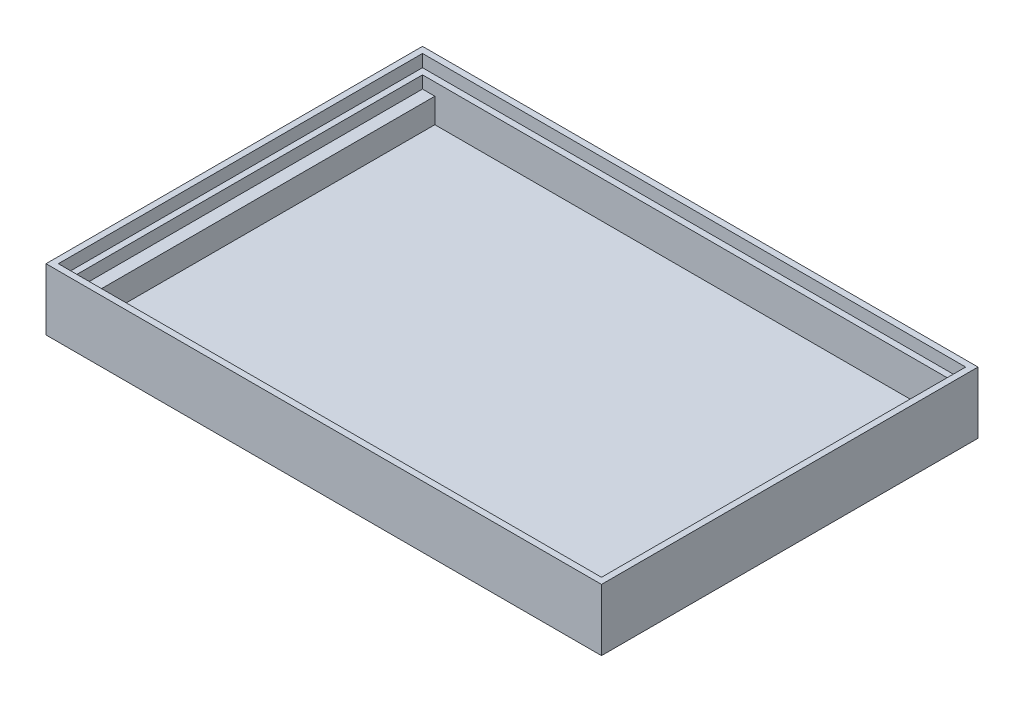
ISO-10303-21;
HEADER;
FILE_DESCRIPTION(('STEP AP214'),'2;1');
FILE_NAME('part.step','',(''),(''),'','','');
FILE_SCHEMA(('AUTOMOTIVE_DESIGN { 1 0 10303 214 1 1 1 1 }'));
ENDSEC;
DATA;
#1=APPLICATION_CONTEXT('core data for automotive mechanical design processes');
#2=APPLICATION_PROTOCOL_DEFINITION('international standard','automotive_design',2000,#1);
#3=PRODUCT_CONTEXT('',#1,'mechanical');
#4=PRODUCT('Part','Part','',(#3));
#5=PRODUCT_RELATED_PRODUCT_CATEGORY('part','',(#4));
#6=PRODUCT_DEFINITION_FORMATION('','',#4);
#7=PRODUCT_DEFINITION_CONTEXT('part definition',#1,'design');
#8=PRODUCT_DEFINITION('design','',#6,#7);
#9=PRODUCT_DEFINITION_SHAPE('','',#8);
#10=(LENGTH_UNIT() NAMED_UNIT(*) SI_UNIT(.MILLI.,.METRE.));
#11=(NAMED_UNIT(*) PLANE_ANGLE_UNIT() SI_UNIT($,.RADIAN.));
#12=(NAMED_UNIT(*) SI_UNIT($,.STERADIAN.) SOLID_ANGLE_UNIT());
#13=UNCERTAINTY_MEASURE_WITH_UNIT(LENGTH_MEASURE(1.E-05),#10,'distance_accuracy_value','');
#14=(GEOMETRIC_REPRESENTATION_CONTEXT(3) GLOBAL_UNCERTAINTY_ASSIGNED_CONTEXT((#13)) GLOBAL_UNIT_ASSIGNED_CONTEXT((#10,
#11,#12)) REPRESENTATION_CONTEXT('',''));
#15=CARTESIAN_POINT('',(0.,0.,0.));
#16=DIRECTION('',(0.,0.,1.));
#17=DIRECTION('',(1.,0.,0.));
#18=AXIS2_PLACEMENT_3D('',#15,#16,#17);
#19=CARTESIAN_POINT('',(88.,10.,-59.));
#20=DIRECTION('',(0.,0.,1.));
#21=DIRECTION('',(1.,0.,0.));
#22=AXIS2_PLACEMENT_3D('',#19,#20,#21);
#23=PLANE('',#22);
#24=DIRECTION('',(0.,-1.,0.));
#25=VECTOR('',#24,1.);
#26=CARTESIAN_POINT('',(88.,10.,-59.));
#27=LINE('',#26,#25);
#28=CARTESIAN_POINT('',(88.,8.,-59.));
#29=VERTEX_POINT('',#28);
#30=CARTESIAN_POINT('',(88.,6.,-59.));
#31=VERTEX_POINT('',#30);
#32=EDGE_CURVE('E194',#29,#31,#27,.T.);
#33=ORIENTED_EDGE('',*,*,#32,.F.);
#34=DIRECTION('',(-1.,0.,0.));
#35=VECTOR('',#34,1.);
#36=CARTESIAN_POINT('',(88.,8.,-59.));
#37=LINE('',#36,#35);
#38=CARTESIAN_POINT('',(2.,8.,-59.));
#39=VERTEX_POINT('',#38);
#40=EDGE_CURVE('E58',#29,#39,#37,.T.);
#41=ORIENTED_EDGE('',*,*,#40,.T.);
#42=DIRECTION('',(0.,-1.,0.));
#43=VECTOR('',#42,1.);
#44=CARTESIAN_POINT('',(2.,10.,-59.));
#45=LINE('',#44,#43);
#46=CARTESIAN_POINT('',(2.,6.,-59.));
#47=VERTEX_POINT('',#46);
#48=EDGE_CURVE('E186',#39,#47,#45,.T.);
#49=ORIENTED_EDGE('',*,*,#48,.T.);
#50=DIRECTION('',(-1.,0.,0.));
#51=VECTOR('',#50,1.);
#52=CARTESIAN_POINT('',(2.,6.,-59.));
#53=LINE('',#52,#51);
#54=CARTESIAN_POINT('',(4.,6.,-59.));
#55=VERTEX_POINT('',#54);
#56=EDGE_CURVE('E301',#55,#47,#53,.T.);
#57=ORIENTED_EDGE('',*,*,#56,.F.);
#58=DIRECTION('',(0.,-1.,0.));
#59=VECTOR('',#58,1.);
#60=CARTESIAN_POINT('',(4.,6.,-59.));
#61=LINE('',#60,#59);
#62=CARTESIAN_POINT('',(4.,2.,-59.));
#63=VERTEX_POINT('',#62);
#64=EDGE_CURVE('E299',#55,#63,#61,.T.);
#65=ORIENTED_EDGE('',*,*,#64,.T.);
#66=DIRECTION('',(-1.,0.,0.));
#67=VECTOR('',#66,1.);
#68=CARTESIAN_POINT('',(88.,2.,-59.));
#69=LINE('',#68,#67);
#70=CARTESIAN_POINT('',(86.,2.,-59.));
#71=VERTEX_POINT('',#70);
#72=EDGE_CURVE('E231',#71,#63,#69,.T.);
#73=ORIENTED_EDGE('',*,*,#72,.F.);
#74=DIRECTION('',(0.,-1.,0.));
#75=VECTOR('',#74,1.);
#76=CARTESIAN_POINT('',(86.,6.,-59.));
#77=LINE('',#76,#75);
#78=CARTESIAN_POINT('',(86.,6.,-59.));
#79=VERTEX_POINT('',#78);
#80=EDGE_CURVE('E311',#79,#71,#77,.T.);
#81=ORIENTED_EDGE('',*,*,#80,.F.);
#82=DIRECTION('',(-1.,0.,0.));
#83=VECTOR('',#82,1.);
#84=CARTESIAN_POINT('',(88.,6.,-59.));
#85=LINE('',#84,#83);
#86=EDGE_CURVE('E331',#31,#79,#85,.T.);
#87=ORIENTED_EDGE('',*,*,#86,.F.);
#88=EDGE_LOOP('',(#33,#41,#49,#57,#65,#73,#81,#87));
#89=FACE_BOUND('',#88,.T.);
#90=ADVANCED_FACE('F32',(#89),#23,.T.);
#91=CARTESIAN_POINT('',(2.,10.,-2.));
#92=DIRECTION('',(0.,0.,-1.));
#93=DIRECTION('',(-1.,0.,0.));
#94=AXIS2_PLACEMENT_3D('',#91,#92,#93);
#95=PLANE('',#94);
#96=DIRECTION('',(0.,-1.,0.));
#97=VECTOR('',#96,1.);
#98=CARTESIAN_POINT('',(2.,10.,-2.));
#99=LINE('',#98,#97);
#100=CARTESIAN_POINT('',(2.,8.,-2.));
#101=VERTEX_POINT('',#100);
#102=CARTESIAN_POINT('',(2.,6.,-2.));
#103=VERTEX_POINT('',#102);
#104=EDGE_CURVE('E184',#101,#103,#99,.T.);
#105=ORIENTED_EDGE('',*,*,#104,.F.);
#106=DIRECTION('',(1.,0.,0.));
#107=VECTOR('',#106,1.);
#108=CARTESIAN_POINT('',(2.,8.,-2.));
#109=LINE('',#108,#107);
#110=CARTESIAN_POINT('',(88.,8.,-2.));
#111=VERTEX_POINT('',#110);
#112=EDGE_CURVE('E170',#101,#111,#109,.T.);
#113=ORIENTED_EDGE('',*,*,#112,.T.);
#114=DIRECTION('',(0.,-1.,0.));
#115=VECTOR('',#114,1.);
#116=CARTESIAN_POINT('',(88.,10.,-2.));
#117=LINE('',#116,#115);
#118=CARTESIAN_POINT('',(88.,6.,-2.));
#119=VERTEX_POINT('',#118);
#120=EDGE_CURVE('E192',#111,#119,#117,.T.);
#121=ORIENTED_EDGE('',*,*,#120,.T.);
#122=DIRECTION('',(1.,0.,0.));
#123=VECTOR('',#122,1.);
#124=CARTESIAN_POINT('',(86.,6.,-2.));
#125=LINE('',#124,#123);
#126=CARTESIAN_POINT('',(86.,6.,-2.));
#127=VERTEX_POINT('',#126);
#128=EDGE_CURVE('E320',#127,#119,#125,.T.);
#129=ORIENTED_EDGE('',*,*,#128,.F.);
#130=DIRECTION('',(0.,-1.,0.));
#131=VECTOR('',#130,1.);
#132=CARTESIAN_POINT('',(86.,6.,-2.));
#133=LINE('',#132,#131);
#134=CARTESIAN_POINT('',(86.,2.,-2.));
#135=VERTEX_POINT('',#134);
#136=EDGE_CURVE('E318',#127,#135,#133,.T.);
#137=ORIENTED_EDGE('',*,*,#136,.T.);
#138=DIRECTION('',(1.,0.,0.));
#139=VECTOR('',#138,1.);
#140=CARTESIAN_POINT('',(2.,2.,-2.));
#141=LINE('',#140,#139);
#142=CARTESIAN_POINT('',(83.,2.,-2.));
#143=VERTEX_POINT('',#142);
#144=EDGE_CURVE('E228',#143,#135,#141,.T.);
#145=ORIENTED_EDGE('',*,*,#144,.F.);
#146=DIRECTION('',(0.,1.,0.));
#147=VECTOR('',#146,1.);
#148=CARTESIAN_POINT('',(83.,0.,-2.));
#149=LINE('',#148,#147);
#150=CARTESIAN_POINT('',(83.,0.,-2.));
#151=VERTEX_POINT('',#150);
#152=EDGE_CURVE('E241',#151,#143,#149,.T.);
#153=ORIENTED_EDGE('',*,*,#152,.F.);
#154=DIRECTION('',(1.,0.,0.));
#155=VECTOR('',#154,1.);
#156=CARTESIAN_POINT('',(57.,0.,-2.));
#157=LINE('',#156,#155);
#158=CARTESIAN_POINT('',(57.,0.,-2.));
#159=VERTEX_POINT('',#158);
#160=EDGE_CURVE('E261',#159,#151,#157,.T.);
#161=ORIENTED_EDGE('',*,*,#160,.F.);
#162=DIRECTION('',(0.,1.,0.));
#163=VECTOR('',#162,1.);
#164=CARTESIAN_POINT('',(57.,0.,-2.));
#165=LINE('',#164,#163);
#166=CARTESIAN_POINT('',(57.,2.,-2.));
#167=VERTEX_POINT('',#166);
#168=EDGE_CURVE('E232',#159,#167,#165,.T.);
#169=ORIENTED_EDGE('',*,*,#168,.T.);
#170=CARTESIAN_POINT('',(4.00000000000001,2.,-2.));
#171=VERTEX_POINT('',#170);
#172=EDGE_CURVE('E36',#171,#167,#141,.T.);
#173=ORIENTED_EDGE('',*,*,#172,.F.);
#174=DIRECTION('',(0.,-1.,0.));
#175=VECTOR('',#174,1.);
#176=CARTESIAN_POINT('',(4.00000000000001,6.,-2.));
#177=LINE('',#176,#175);
#178=CARTESIAN_POINT('',(4.00000000000001,6.,-2.));
#179=VERTEX_POINT('',#178);
#180=EDGE_CURVE('E254',#179,#171,#177,.T.);
#181=ORIENTED_EDGE('',*,*,#180,.F.);
#182=DIRECTION('',(1.,0.,0.));
#183=VECTOR('',#182,1.);
#184=CARTESIAN_POINT('',(4.00000000000001,6.,-2.));
#185=LINE('',#184,#183);
#186=EDGE_CURVE('E191',#103,#179,#185,.T.);
#187=ORIENTED_EDGE('',*,*,#186,.F.);
#188=EDGE_LOOP('',(#105,#113,#121,#129,#137,#145,#153,#161,#169,#173,#181,#187));
#189=FACE_BOUND('',#188,.T.);
#190=ADVANCED_FACE('F189',(#189),#95,.T.);
#191=CARTESIAN_POINT('',(2.,10.,-59.));
#192=DIRECTION('',(1.,0.,0.));
#193=DIRECTION('',(0.,0.,-1.));
#194=AXIS2_PLACEMENT_3D('',#191,#192,#193);
#195=PLANE('',#194);
#196=ORIENTED_EDGE('',*,*,#48,.F.);
#197=DIRECTION('',(0.,0.,1.));
#198=VECTOR('',#197,1.);
#199=CARTESIAN_POINT('',(2.,8.,-59.));
#200=LINE('',#199,#198);
#201=EDGE_CURVE('E174',#39,#101,#200,.T.);
#202=ORIENTED_EDGE('',*,*,#201,.T.);
#203=ORIENTED_EDGE('',*,*,#104,.T.);
#204=DIRECTION('',(0.,0.,1.));
#205=VECTOR('',#204,1.);
#206=CARTESIAN_POINT('',(2.,6.,-2.));
#207=LINE('',#206,#205);
#208=EDGE_CURVE('E310',#47,#103,#207,.T.);
#209=ORIENTED_EDGE('',*,*,#208,.F.);
#210=EDGE_LOOP('',(#196,#202,#203,#209));
#211=FACE_BOUND('',#210,.T.);
#212=ADVANCED_FACE('F182',(#211),#195,.T.);
#213=CARTESIAN_POINT('',(88.,10.,-2.));
#214=DIRECTION('',(-1.,0.,0.));
#215=DIRECTION('',(0.,0.,1.));
#216=AXIS2_PLACEMENT_3D('',#213,#214,#215);
#217=PLANE('',#216);
#218=ORIENTED_EDGE('',*,*,#120,.F.);
#219=DIRECTION('',(0.,0.,-1.));
#220=VECTOR('',#219,1.);
#221=CARTESIAN_POINT('',(88.,8.,-2.));
#222=LINE('',#221,#220);
#223=EDGE_CURVE('E175',#111,#29,#222,.T.);
#224=ORIENTED_EDGE('',*,*,#223,.T.);
#225=ORIENTED_EDGE('',*,*,#32,.T.);
#226=DIRECTION('',(0.,0.,-1.));
#227=VECTOR('',#226,1.);
#228=CARTESIAN_POINT('',(88.,6.,-2.));
#229=LINE('',#228,#227);
#230=EDGE_CURVE('E324',#119,#31,#229,.T.);
#231=ORIENTED_EDGE('',*,*,#230,.F.);
#232=EDGE_LOOP('',(#218,#224,#225,#231));
#233=FACE_BOUND('',#232,.T.);
#234=ADVANCED_FACE('F368',(#233),#217,.T.);
#235=CARTESIAN_POINT('',(0.,2.,0.));
#236=DIRECTION('',(0.,1.,0.));
#237=DIRECTION('',(0.,0.,1.));
#238=AXIS2_PLACEMENT_3D('',#235,#236,#237);
#239=PLANE('',#238);
#240=ORIENTED_EDGE('',*,*,#144,.T.);
#241=DIRECTION('',(0.,0.,1.));
#242=VECTOR('',#241,1.);
#243=CARTESIAN_POINT('',(86.,2.,-59.));
#244=LINE('',#243,#242);
#245=EDGE_CURVE('E321',#71,#135,#244,.T.);
#246=ORIENTED_EDGE('',*,*,#245,.F.);
#247=ORIENTED_EDGE('',*,*,#72,.T.);
#248=DIRECTION('',(0.,0.,-1.));
#249=VECTOR('',#248,1.);
#250=CARTESIAN_POINT('',(4.,2.,-59.));
#251=LINE('',#250,#249);
#252=EDGE_CURVE('E296',#171,#63,#251,.T.);
#253=ORIENTED_EDGE('',*,*,#252,.F.);
#254=ORIENTED_EDGE('',*,*,#172,.T.);
#255=DIRECTION('',(0.,0.,1.));
#256=VECTOR('',#255,1.);
#257=CARTESIAN_POINT('',(57.,2.,-9.));
#258=LINE('',#257,#256);
#259=CARTESIAN_POINT('',(57.,2.,-9.));
#260=VERTEX_POINT('',#259);
#261=EDGE_CURVE('E246',#260,#167,#258,.T.);
#262=ORIENTED_EDGE('',*,*,#261,.F.);
#263=DIRECTION('',(-1.,0.,0.));
#264=VECTOR('',#263,1.);
#265=CARTESIAN_POINT('',(83.,2.,-9.));
#266=LINE('',#265,#264);
#267=CARTESIAN_POINT('',(83.,2.,-9.));
#268=VERTEX_POINT('',#267);
#269=EDGE_CURVE('E244',#268,#260,#266,.T.);
#270=ORIENTED_EDGE('',*,*,#269,.F.);
#271=DIRECTION('',(0.,0.,-1.));
#272=VECTOR('',#271,1.);
#273=CARTESIAN_POINT('',(83.,2.,-2.));
#274=LINE('',#273,#272);
#275=EDGE_CURVE('E247',#143,#268,#274,.T.);
#276=ORIENTED_EDGE('',*,*,#275,.F.);
#277=EDGE_LOOP('',(#240,#246,#247,#253,#254,#262,#270,#276));
#278=FACE_BOUND('',#277,.T.);
#279=ADVANCED_FACE('F293',(#278),#239,.T.);
#280=CARTESIAN_POINT('',(0.,2.,-61.));
#281=DIRECTION('',(1.,0.,0.));
#282=DIRECTION('',(0.,0.,-1.));
#283=AXIS2_PLACEMENT_3D('',#280,#281,#282);
#284=PLANE('',#283);
#285=DIRECTION('',(0.,0.,1.));
#286=VECTOR('',#285,1.);
#287=CARTESIAN_POINT('',(0.,0.,-61.));
#288=LINE('',#287,#286);
#289=CARTESIAN_POINT('',(0.,0.,-61.));
#290=VERTEX_POINT('',#289);
#291=CARTESIAN_POINT('',(0.,0.,0.));
#292=VERTEX_POINT('',#291);
#293=EDGE_CURVE('E211',#290,#292,#288,.T.);
#294=ORIENTED_EDGE('',*,*,#293,.T.);
#295=DIRECTION('',(0.,-1.,0.));
#296=VECTOR('',#295,1.);
#297=CARTESIAN_POINT('',(0.,2.,0.));
#298=LINE('',#297,#296);
#299=CARTESIAN_POINT('',(0.,10.,0.));
#300=VERTEX_POINT('',#299);
#301=EDGE_CURVE('E11',#300,#292,#298,.T.);
#302=ORIENTED_EDGE('',*,*,#301,.F.);
#303=DIRECTION('',(0.,0.,1.));
#304=VECTOR('',#303,1.);
#305=CARTESIAN_POINT('',(0.,10.,-61.));
#306=LINE('',#305,#304);
#307=CARTESIAN_POINT('',(0.,10.,-61.));
#308=VERTEX_POINT('',#307);
#309=EDGE_CURVE('E205',#308,#300,#306,.T.);
#310=ORIENTED_EDGE('',*,*,#309,.F.);
#311=DIRECTION('',(0.,-1.,0.));
#312=VECTOR('',#311,1.);
#313=CARTESIAN_POINT('',(0.,2.,-61.));
#314=LINE('',#313,#312);
#315=EDGE_CURVE('E220',#308,#290,#314,.T.);
#316=ORIENTED_EDGE('',*,*,#315,.T.);
#317=EDGE_LOOP('',(#294,#302,#310,#316));
#318=FACE_BOUND('',#317,.T.);
#319=ADVANCED_FACE('F34',(#318),#284,.F.);
#320=CARTESIAN_POINT('',(0.,2.,0.));
#321=DIRECTION('',(0.,0.,-1.));
#322=DIRECTION('',(-1.,0.,0.));
#323=AXIS2_PLACEMENT_3D('',#320,#321,#322);
#324=PLANE('',#323);
#325=DIRECTION('',(1.,0.,0.));
#326=VECTOR('',#325,1.);
#327=CARTESIAN_POINT('',(0.,0.,0.));
#328=LINE('',#327,#326);
#329=CARTESIAN_POINT('',(90.,0.,0.));
#330=VERTEX_POINT('',#329);
#331=EDGE_CURVE('E214',#292,#330,#328,.T.);
#332=ORIENTED_EDGE('',*,*,#331,.T.);
#333=DIRECTION('',(0.,-1.,0.));
#334=VECTOR('',#333,1.);
#335=CARTESIAN_POINT('',(90.,2.,0.));
#336=LINE('',#335,#334);
#337=CARTESIAN_POINT('',(90.,10.,0.));
#338=VERTEX_POINT('',#337);
#339=EDGE_CURVE('E42',#338,#330,#336,.T.);
#340=ORIENTED_EDGE('',*,*,#339,.F.);
#341=DIRECTION('',(1.,0.,0.));
#342=VECTOR('',#341,1.);
#343=CARTESIAN_POINT('',(0.,10.,0.));
#344=LINE('',#343,#342);
#345=EDGE_CURVE('E208',#300,#338,#344,.T.);
#346=ORIENTED_EDGE('',*,*,#345,.F.);
#347=ORIENTED_EDGE('',*,*,#301,.T.);
#348=EDGE_LOOP('',(#332,#340,#346,#347));
#349=FACE_BOUND('',#348,.T.);
#350=ADVANCED_FACE('F413',(#349),#324,.F.);
#351=CARTESIAN_POINT('',(90.,2.,0.));
#352=DIRECTION('',(-1.,0.,0.));
#353=DIRECTION('',(0.,0.,1.));
#354=AXIS2_PLACEMENT_3D('',#351,#352,#353);
#355=PLANE('',#354);
#356=DIRECTION('',(0.,0.,-1.));
#357=VECTOR('',#356,1.);
#358=CARTESIAN_POINT('',(90.,0.,0.));
#359=LINE('',#358,#357);
#360=CARTESIAN_POINT('',(90.,0.,-61.));
#361=VERTEX_POINT('',#360);
#362=EDGE_CURVE('E216',#330,#361,#359,.T.);
#363=ORIENTED_EDGE('',*,*,#362,.T.);
#364=DIRECTION('',(0.,-1.,0.));
#365=VECTOR('',#364,1.);
#366=CARTESIAN_POINT('',(90.,2.,-61.));
#367=LINE('',#366,#365);
#368=CARTESIAN_POINT('',(90.,10.,-61.));
#369=VERTEX_POINT('',#368);
#370=EDGE_CURVE('E223',#369,#361,#367,.T.);
#371=ORIENTED_EDGE('',*,*,#370,.F.);
#372=DIRECTION('',(0.,0.,-1.));
#373=VECTOR('',#372,1.);
#374=CARTESIAN_POINT('',(90.,10.,0.));
#375=LINE('',#374,#373);
#376=EDGE_CURVE('E199',#338,#369,#375,.T.);
#377=ORIENTED_EDGE('',*,*,#376,.F.);
#378=ORIENTED_EDGE('',*,*,#339,.T.);
#379=EDGE_LOOP('',(#363,#371,#377,#378));
#380=FACE_BOUND('',#379,.T.);
#381=ADVANCED_FACE('F410',(#380),#355,.F.);
#382=CARTESIAN_POINT('',(90.,2.,-61.));
#383=DIRECTION('',(0.,0.,1.));
#384=DIRECTION('',(1.,0.,0.));
#385=AXIS2_PLACEMENT_3D('',#382,#383,#384);
#386=PLANE('',#385);
#387=DIRECTION('',(-1.,0.,0.));
#388=VECTOR('',#387,1.);
#389=CARTESIAN_POINT('',(90.,0.,-61.));
#390=LINE('',#389,#388);
#391=EDGE_CURVE('E218',#361,#290,#390,.T.);
#392=ORIENTED_EDGE('',*,*,#391,.T.);
#393=ORIENTED_EDGE('',*,*,#315,.F.);
#394=DIRECTION('',(-1.,0.,0.));
#395=VECTOR('',#394,1.);
#396=CARTESIAN_POINT('',(90.,10.,-61.));
#397=LINE('',#396,#395);
#398=EDGE_CURVE('E202',#369,#308,#397,.T.);
#399=ORIENTED_EDGE('',*,*,#398,.F.);
#400=ORIENTED_EDGE('',*,*,#370,.T.);
#401=EDGE_LOOP('',(#392,#393,#399,#400));
#402=FACE_BOUND('',#401,.T.);
#403=ADVANCED_FACE('F407',(#402),#386,.F.);
#404=CARTESIAN_POINT('',(0.,0.,0.));
#405=DIRECTION('',(0.,1.,0.));
#406=DIRECTION('',(0.,0.,1.));
#407=AXIS2_PLACEMENT_3D('',#404,#405,#406);
#408=PLANE('',#407);
#409=DIRECTION('',(0.,0.,1.));
#410=VECTOR('',#409,1.);
#411=CARTESIAN_POINT('',(57.,0.,-9.));
#412=LINE('',#411,#410);
#413=CARTESIAN_POINT('',(57.,0.,-9.));
#414=VERTEX_POINT('',#413);
#415=EDGE_CURVE('E250',#414,#159,#412,.T.);
#416=ORIENTED_EDGE('',*,*,#415,.T.);
#417=ORIENTED_EDGE('',*,*,#160,.T.);
#418=DIRECTION('',(0.,0.,-1.));
#419=VECTOR('',#418,1.);
#420=CARTESIAN_POINT('',(83.,0.,-2.));
#421=LINE('',#420,#419);
#422=CARTESIAN_POINT('',(83.,0.,-9.));
#423=VERTEX_POINT('',#422);
#424=EDGE_CURVE('E266',#151,#423,#421,.T.);
#425=ORIENTED_EDGE('',*,*,#424,.T.);
#426=DIRECTION('',(-1.,0.,0.));
#427=VECTOR('',#426,1.);
#428=CARTESIAN_POINT('',(83.,0.,-9.));
#429=LINE('',#428,#427);
#430=EDGE_CURVE('E272',#423,#414,#429,.T.);
#431=ORIENTED_EDGE('',*,*,#430,.T.);
#432=EDGE_LOOP('',(#416,#417,#425,#431));
#433=FACE_BOUND('',#432,.T.);
#434=ORIENTED_EDGE('',*,*,#293,.F.);
#435=ORIENTED_EDGE('',*,*,#391,.F.);
#436=ORIENTED_EDGE('',*,*,#362,.F.);
#437=ORIENTED_EDGE('',*,*,#331,.F.);
#438=EDGE_LOOP('',(#434,#435,#436,#437));
#439=FACE_BOUND('',#438,.T.);
#440=ADVANCED_FACE('F278',(#433,#439),#408,.F.);
#441=CARTESIAN_POINT('',(0.,10.,0.));
#442=DIRECTION('',(0.,1.,0.));
#443=DIRECTION('',(0.,0.,1.));
#444=AXIS2_PLACEMENT_3D('',#441,#442,#443);
#445=PLANE('',#444);
#446=DIRECTION('',(0.,0.,-1.));
#447=VECTOR('',#446,1.);
#448=CARTESIAN_POINT('',(89.,10.,-1.));
#449=LINE('',#448,#447);
#450=CARTESIAN_POINT('',(89.,10.,-1.));
#451=VERTEX_POINT('',#450);
#452=CARTESIAN_POINT('',(89.,10.,-60.));
#453=VERTEX_POINT('',#452);
#454=EDGE_CURVE('E50',#451,#453,#449,.T.);
#455=ORIENTED_EDGE('',*,*,#454,.F.);
#456=DIRECTION('',(1.,0.,0.));
#457=VECTOR('',#456,1.);
#458=CARTESIAN_POINT('',(1.,10.,-1.));
#459=LINE('',#458,#457);
#460=CARTESIAN_POINT('',(1.,10.,-1.));
#461=VERTEX_POINT('',#460);
#462=EDGE_CURVE('E344',#461,#451,#459,.T.);
#463=ORIENTED_EDGE('',*,*,#462,.F.);
#464=DIRECTION('',(0.,0.,1.));
#465=VECTOR('',#464,1.);
#466=CARTESIAN_POINT('',(1.,10.,-60.));
#467=LINE('',#466,#465);
#468=CARTESIAN_POINT('',(1.,10.,-60.));
#469=VERTEX_POINT('',#468);
#470=EDGE_CURVE('E348',#469,#461,#467,.T.);
#471=ORIENTED_EDGE('',*,*,#470,.F.);
#472=DIRECTION('',(-1.,0.,0.));
#473=VECTOR('',#472,1.);
#474=CARTESIAN_POINT('',(89.,10.,-60.));
#475=LINE('',#474,#473);
#476=EDGE_CURVE('E351',#453,#469,#475,.T.);
#477=ORIENTED_EDGE('',*,*,#476,.F.);
#478=EDGE_LOOP('',(#455,#463,#471,#477));
#479=FACE_BOUND('',#478,.T.);
#480=ORIENTED_EDGE('',*,*,#376,.T.);
#481=ORIENTED_EDGE('',*,*,#398,.T.);
#482=ORIENTED_EDGE('',*,*,#309,.T.);
#483=ORIENTED_EDGE('',*,*,#345,.T.);
#484=EDGE_LOOP('',(#480,#481,#482,#483));
#485=FACE_BOUND('',#484,.T.);
#486=ADVANCED_FACE('F399',(#479,#485),#445,.T.);
#487=CARTESIAN_POINT('',(57.,0.,-9.));
#488=DIRECTION('',(-1.,0.,0.));
#489=DIRECTION('',(0.,0.,1.));
#490=AXIS2_PLACEMENT_3D('',#487,#488,#489);
#491=PLANE('',#490);
#492=ORIENTED_EDGE('',*,*,#261,.T.);
#493=ORIENTED_EDGE('',*,*,#168,.F.);
#494=ORIENTED_EDGE('',*,*,#415,.F.);
#495=DIRECTION('',(0.,1.,0.));
#496=VECTOR('',#495,1.);
#497=CARTESIAN_POINT('',(57.,0.,-9.));
#498=LINE('',#497,#496);
#499=EDGE_CURVE('E240',#414,#260,#498,.T.);
#500=ORIENTED_EDGE('',*,*,#499,.T.);
#501=EDGE_LOOP('',(#492,#493,#494,#500));
#502=FACE_BOUND('',#501,.T.);
#503=ADVANCED_FACE('F280',(#502),#491,.F.);
#504=CARTESIAN_POINT('',(83.,0.,-9.));
#505=DIRECTION('',(0.,0.,-1.));
#506=DIRECTION('',(-1.,0.,0.));
#507=AXIS2_PLACEMENT_3D('',#504,#505,#506);
#508=PLANE('',#507);
#509=ORIENTED_EDGE('',*,*,#269,.T.);
#510=ORIENTED_EDGE('',*,*,#499,.F.);
#511=ORIENTED_EDGE('',*,*,#430,.F.);
#512=DIRECTION('',(0.,1.,0.));
#513=VECTOR('',#512,1.);
#514=CARTESIAN_POINT('',(83.,0.,-9.));
#515=LINE('',#514,#513);
#516=EDGE_CURVE('E238',#423,#268,#515,.T.);
#517=ORIENTED_EDGE('',*,*,#516,.T.);
#518=EDGE_LOOP('',(#509,#510,#511,#517));
#519=FACE_BOUND('',#518,.T.);
#520=ADVANCED_FACE('F291',(#519),#508,.F.);
#521=CARTESIAN_POINT('',(83.,0.,-2.));
#522=DIRECTION('',(1.,0.,0.));
#523=DIRECTION('',(0.,0.,-1.));
#524=AXIS2_PLACEMENT_3D('',#521,#522,#523);
#525=PLANE('',#524);
#526=ORIENTED_EDGE('',*,*,#275,.T.);
#527=ORIENTED_EDGE('',*,*,#516,.F.);
#528=ORIENTED_EDGE('',*,*,#424,.F.);
#529=ORIENTED_EDGE('',*,*,#152,.T.);
#530=EDGE_LOOP('',(#526,#527,#528,#529));
#531=FACE_BOUND('',#530,.T.);
#532=ADVANCED_FACE('F288',(#531),#525,.F.);
#533=CARTESIAN_POINT('',(4.,6.,-59.));
#534=DIRECTION('',(-1.,0.,0.));
#535=DIRECTION('',(0.,0.,1.));
#536=AXIS2_PLACEMENT_3D('',#533,#534,#535);
#537=PLANE('',#536);
#538=ORIENTED_EDGE('',*,*,#252,.T.);
#539=ORIENTED_EDGE('',*,*,#64,.F.);
#540=DIRECTION('',(0.,0.,-1.));
#541=VECTOR('',#540,1.);
#542=CARTESIAN_POINT('',(4.,6.,-59.));
#543=LINE('',#542,#541);
#544=EDGE_CURVE('E307',#179,#55,#543,.T.);
#545=ORIENTED_EDGE('',*,*,#544,.F.);
#546=ORIENTED_EDGE('',*,*,#180,.T.);
#547=EDGE_LOOP('',(#538,#539,#545,#546));
#548=FACE_BOUND('',#547,.T.);
#549=ADVANCED_FACE('F386',(#548),#537,.F.);
#550=CARTESIAN_POINT('',(0.,6.,0.));
#551=DIRECTION('',(0.,-1.,0.));
#552=DIRECTION('',(0.,0.,-1.));
#553=AXIS2_PLACEMENT_3D('',#550,#551,#552);
#554=PLANE('',#553);
#555=ORIENTED_EDGE('',*,*,#208,.T.);
#556=ORIENTED_EDGE('',*,*,#186,.T.);
#557=ORIENTED_EDGE('',*,*,#544,.T.);
#558=ORIENTED_EDGE('',*,*,#56,.T.);
#559=EDGE_LOOP('',(#555,#556,#557,#558));
#560=FACE_BOUND('',#559,.T.);
#561=ADVANCED_FACE('F378',(#560),#554,.F.);
#562=CARTESIAN_POINT('',(86.,6.,-59.));
#563=DIRECTION('',(1.,0.,0.));
#564=DIRECTION('',(0.,0.,-1.));
#565=AXIS2_PLACEMENT_3D('',#562,#563,#564);
#566=PLANE('',#565);
#567=ORIENTED_EDGE('',*,*,#245,.T.);
#568=ORIENTED_EDGE('',*,*,#136,.F.);
#569=DIRECTION('',(0.,0.,1.));
#570=VECTOR('',#569,1.);
#571=CARTESIAN_POINT('',(86.,6.,-59.));
#572=LINE('',#571,#570);
#573=EDGE_CURVE('E328',#79,#127,#572,.T.);
#574=ORIENTED_EDGE('',*,*,#573,.F.);
#575=ORIENTED_EDGE('',*,*,#80,.T.);
#576=EDGE_LOOP('',(#567,#568,#574,#575));
#577=FACE_BOUND('',#576,.T.);
#578=ADVANCED_FACE('F376',(#577),#566,.F.);
#579=CARTESIAN_POINT('',(0.,6.,0.));
#580=DIRECTION('',(0.,1.,0.));
#581=DIRECTION('',(0.,0.,1.));
#582=AXIS2_PLACEMENT_3D('',#579,#580,#581);
#583=PLANE('',#582);
#584=ORIENTED_EDGE('',*,*,#230,.T.);
#585=ORIENTED_EDGE('',*,*,#86,.T.);
#586=ORIENTED_EDGE('',*,*,#573,.T.);
#587=ORIENTED_EDGE('',*,*,#128,.T.);
#588=EDGE_LOOP('',(#584,#585,#586,#587));
#589=FACE_BOUND('',#588,.T.);
#590=ADVANCED_FACE('F373',(#589),#583,.T.);
#591=CARTESIAN_POINT('',(89.,8.,-1.));
#592=DIRECTION('',(1.,0.,0.));
#593=DIRECTION('',(0.,0.,-1.));
#594=AXIS2_PLACEMENT_3D('',#591,#592,#593);
#595=PLANE('',#594);
#596=ORIENTED_EDGE('',*,*,#454,.T.);
#597=DIRECTION('',(0.,1.,0.));
#598=VECTOR('',#597,1.);
#599=CARTESIAN_POINT('',(89.,8.,-60.));
#600=LINE('',#599,#598);
#601=CARTESIAN_POINT('',(89.,8.,-60.));
#602=VERTEX_POINT('',#601);
#603=EDGE_CURVE('E336',#602,#453,#600,.T.);
#604=ORIENTED_EDGE('',*,*,#603,.F.);
#605=DIRECTION('',(0.,0.,-1.));
#606=VECTOR('',#605,1.);
#607=CARTESIAN_POINT('',(89.,8.,-1.));
#608=LINE('',#607,#606);
#609=CARTESIAN_POINT('',(89.,8.,-1.));
#610=VERTEX_POINT('',#609);
#611=EDGE_CURVE('E347',#610,#602,#608,.T.);
#612=ORIENTED_EDGE('',*,*,#611,.F.);
#613=DIRECTION('',(0.,1.,0.));
#614=VECTOR('',#613,1.);
#615=CARTESIAN_POINT('',(89.,8.,-1.));
#616=LINE('',#615,#614);
#617=EDGE_CURVE('E325',#610,#451,#616,.T.);
#618=ORIENTED_EDGE('',*,*,#617,.T.);
#619=EDGE_LOOP('',(#596,#604,#612,#618));
#620=FACE_BOUND('',#619,.T.);
#621=ADVANCED_FACE('F384',(#620),#595,.F.);
#622=CARTESIAN_POINT('',(1.,8.,-1.));
#623=DIRECTION('',(0.,0.,1.));
#624=DIRECTION('',(1.,0.,0.));
#625=AXIS2_PLACEMENT_3D('',#622,#623,#624);
#626=PLANE('',#625);
#627=ORIENTED_EDGE('',*,*,#462,.T.);
#628=ORIENTED_EDGE('',*,*,#617,.F.);
#629=DIRECTION('',(1.,0.,0.));
#630=VECTOR('',#629,1.);
#631=CARTESIAN_POINT('',(1.,8.,-1.));
#632=LINE('',#631,#630);
#633=CARTESIAN_POINT('',(1.,8.,-1.));
#634=VERTEX_POINT('',#633);
#635=EDGE_CURVE('E339',#634,#610,#632,.T.);
#636=ORIENTED_EDGE('',*,*,#635,.F.);
#637=DIRECTION('',(0.,1.,0.));
#638=VECTOR('',#637,1.);
#639=CARTESIAN_POINT('',(1.,8.,-1.));
#640=LINE('',#639,#638);
#641=EDGE_CURVE('E341',#634,#461,#640,.T.);
#642=ORIENTED_EDGE('',*,*,#641,.T.);
#643=EDGE_LOOP('',(#627,#628,#636,#642));
#644=FACE_BOUND('',#643,.T.);
#645=ADVANCED_FACE('F554',(#644),#626,.F.);
#646=CARTESIAN_POINT('',(1.,8.,-60.));
#647=DIRECTION('',(-1.,0.,0.));
#648=DIRECTION('',(0.,0.,1.));
#649=AXIS2_PLACEMENT_3D('',#646,#647,#648);
#650=PLANE('',#649);
#651=ORIENTED_EDGE('',*,*,#470,.T.);
#652=ORIENTED_EDGE('',*,*,#641,.F.);
#653=DIRECTION('',(0.,0.,1.));
#654=VECTOR('',#653,1.);
#655=CARTESIAN_POINT('',(1.,8.,-60.));
#656=LINE('',#655,#654);
#657=CARTESIAN_POINT('',(1.,8.,-60.));
#658=VERTEX_POINT('',#657);
#659=EDGE_CURVE('E357',#658,#634,#656,.T.);
#660=ORIENTED_EDGE('',*,*,#659,.F.);
#661=DIRECTION('',(0.,1.,0.));
#662=VECTOR('',#661,1.);
#663=CARTESIAN_POINT('',(1.,8.,-60.));
#664=LINE('',#663,#662);
#665=EDGE_CURVE('E338',#658,#469,#664,.T.);
#666=ORIENTED_EDGE('',*,*,#665,.T.);
#667=EDGE_LOOP('',(#651,#652,#660,#666));
#668=FACE_BOUND('',#667,.T.);
#669=ADVANCED_FACE('F563',(#668),#650,.F.);
#670=CARTESIAN_POINT('',(89.,8.,-60.));
#671=DIRECTION('',(0.,0.,-1.));
#672=DIRECTION('',(-1.,0.,0.));
#673=AXIS2_PLACEMENT_3D('',#670,#671,#672);
#674=PLANE('',#673);
#675=ORIENTED_EDGE('',*,*,#476,.T.);
#676=ORIENTED_EDGE('',*,*,#665,.F.);
#677=DIRECTION('',(-1.,0.,0.));
#678=VECTOR('',#677,1.);
#679=CARTESIAN_POINT('',(89.,8.,-60.));
#680=LINE('',#679,#678);
#681=EDGE_CURVE('E360',#602,#658,#680,.T.);
#682=ORIENTED_EDGE('',*,*,#681,.F.);
#683=ORIENTED_EDGE('',*,*,#603,.T.);
#684=EDGE_LOOP('',(#675,#676,#682,#683));
#685=FACE_BOUND('',#684,.T.);
#686=ADVANCED_FACE('F573',(#685),#674,.F.);
#687=CARTESIAN_POINT('',(0.,8.,0.));
#688=DIRECTION('',(0.,1.,0.));
#689=DIRECTION('',(0.,0.,1.));
#690=AXIS2_PLACEMENT_3D('',#687,#688,#689);
#691=PLANE('',#690);
#692=ORIENTED_EDGE('',*,*,#112,.F.);
#693=ORIENTED_EDGE('',*,*,#201,.F.);
#694=ORIENTED_EDGE('',*,*,#40,.F.);
#695=ORIENTED_EDGE('',*,*,#223,.F.);
#696=EDGE_LOOP('',(#692,#693,#694,#695));
#697=FACE_BOUND('',#696,.T.);
#698=ORIENTED_EDGE('',*,*,#611,.T.);
#699=ORIENTED_EDGE('',*,*,#681,.T.);
#700=ORIENTED_EDGE('',*,*,#659,.T.);
#701=ORIENTED_EDGE('',*,*,#635,.T.);
#702=EDGE_LOOP('',(#698,#699,#700,#701));
#703=FACE_BOUND('',#702,.T.);
#704=ADVANCED_FACE('F172',(#697,#703),#691,.T.);
#705=CLOSED_SHELL('',(#90,#190,#212,#234,#279,#319,#350,#381,#403,#440,#486,#503,#520,#532,#549,
#561,#578,#590,#621,#645,#669,#686,#704));
#706=MANIFOLD_SOLID_BREP('B2',#705);
#707=ADVANCED_BREP_SHAPE_REPRESENTATION('',(#18,#706),#14);
#708=SHAPE_DEFINITION_REPRESENTATION(#9,#707);
ENDSEC;
END-ISO-10303-21;
